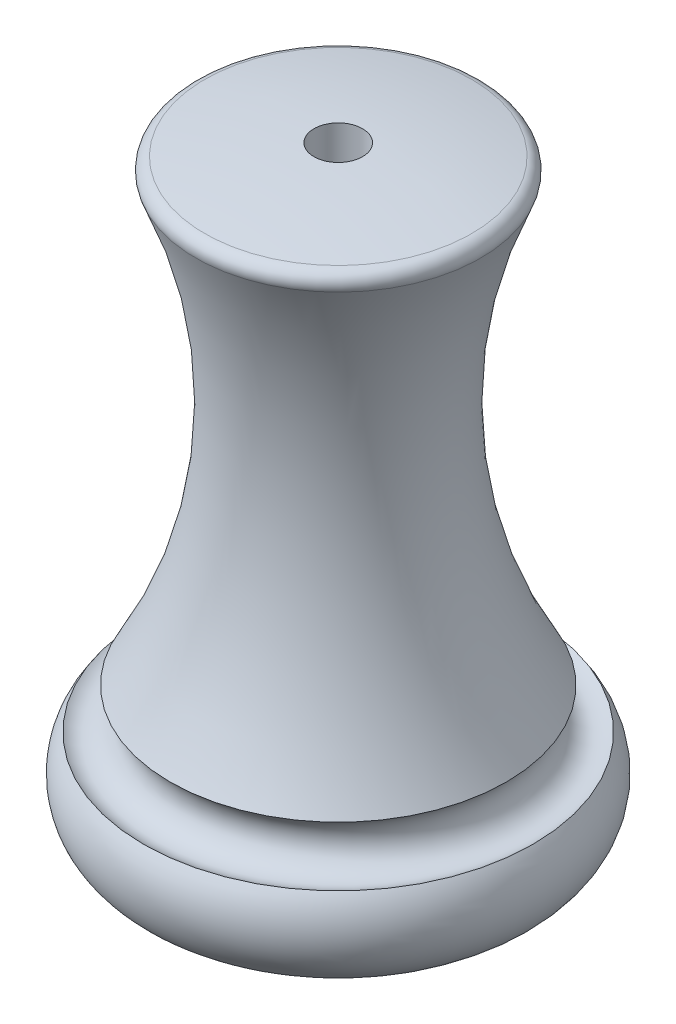
ISO-10303-21;
HEADER;
FILE_DESCRIPTION(('STEP AP214'),'2;1');
FILE_NAME('part.step','',(''),(''),'','','');
FILE_SCHEMA(('AUTOMOTIVE_DESIGN { 1 0 10303 214 1 1 1 1 }'));
ENDSEC;
DATA;
#1=APPLICATION_CONTEXT('core data for automotive mechanical design processes');
#2=APPLICATION_PROTOCOL_DEFINITION('international standard','automotive_design',2000,#1);
#3=PRODUCT_CONTEXT('',#1,'mechanical');
#4=PRODUCT('Part','Part','',(#3));
#5=PRODUCT_RELATED_PRODUCT_CATEGORY('part','',(#4));
#6=PRODUCT_DEFINITION_FORMATION('','',#4);
#7=PRODUCT_DEFINITION_CONTEXT('part definition',#1,'design');
#8=PRODUCT_DEFINITION('design','',#6,#7);
#9=PRODUCT_DEFINITION_SHAPE('','',#8);
#10=(LENGTH_UNIT() NAMED_UNIT(*) SI_UNIT(.MILLI.,.METRE.));
#11=(NAMED_UNIT(*) PLANE_ANGLE_UNIT() SI_UNIT($,.RADIAN.));
#12=(NAMED_UNIT(*) SI_UNIT($,.STERADIAN.) SOLID_ANGLE_UNIT());
#13=UNCERTAINTY_MEASURE_WITH_UNIT(LENGTH_MEASURE(1.E-05),#10,'distance_accuracy_value','');
#14=(GEOMETRIC_REPRESENTATION_CONTEXT(3) GLOBAL_UNCERTAINTY_ASSIGNED_CONTEXT((#13)) GLOBAL_UNIT_ASSIGNED_CONTEXT((#10,
#11,#12)) REPRESENTATION_CONTEXT('',''));
#15=CARTESIAN_POINT('',(0.,0.,0.));
#16=DIRECTION('',(0.,0.,1.));
#17=DIRECTION('',(1.,0.,0.));
#18=AXIS2_PLACEMENT_3D('',#15,#16,#17);
#19=CARTESIAN_POINT('',(0.,-9.99999999999999,0.));
#20=DIRECTION('',(0.,-1.,0.));
#21=DIRECTION('',(0.,0.,-1.));
#22=AXIS2_PLACEMENT_3D('',#19,#20,#21);
#23=SPHERICAL_SURFACE('',#22,60.);
#24=CARTESIAN_POINT('',(0.,49.9666574022598,0.));
#25=DIRECTION('',(0.,-1.,0.));
#26=DIRECTION('',(0.,0.,-1.));
#27=AXIS2_PLACEMENT_3D('',#24,#25,#26);
#28=CIRCLE('',#27,2.);
#29=CARTESIAN_POINT('',(0.,49.9666574022598,-2.));
#30=VERTEX_POINT('',#29);
#31=EDGE_CURVE('E77',#30,#30,#28,.F.);
#32=ORIENTED_EDGE('',*,*,#31,.F.);
#33=EDGE_LOOP('',(#32));
#34=FACE_BOUND('',#33,.T.);
#35=CARTESIAN_POINT('',(0.,48.9830508474576,0.));
#36=DIRECTION('',(0.,-1.,0.));
#37=DIRECTION('',(0.,0.,-1.));
#38=AXIS2_PLACEMENT_3D('',#35,#36,#37);
#39=CIRCLE('',#38,10.9999869420935);
#40=CARTESIAN_POINT('',(0.,48.9830508474576,-10.9999869420935));
#41=VERTEX_POINT('',#40);
#42=EDGE_CURVE('E12',#41,#41,#39,.T.);
#43=ORIENTED_EDGE('',*,*,#42,.F.);
#44=EDGE_LOOP('',(#43));
#45=FACE_BOUND('',#44,.T.);
#46=ADVANCED_FACE('F47',(#34,#45),#23,.T.);
#47=CARTESIAN_POINT('',(0.,48.,0.));
#48=DIRECTION('',(0.,-1.,0.));
#49=DIRECTION('',(0.,0.,-1.));
#50=AXIS2_PLACEMENT_3D('',#47,#48,#49);
#51=TOROIDAL_SURFACE('',#50,10.816653826392,1.00000000000001);
#52=ORIENTED_EDGE('',*,*,#42,.T.);
#53=EDGE_LOOP('',(#52));
#54=FACE_BOUND('',#53,.T.);
#55=CARTESIAN_POINT('',(0.,47.5979713569628,0.));
#56=DIRECTION('',(0.,-1.,0.));
#57=DIRECTION('',(0.,0.,-1.));
#58=AXIS2_PLACEMENT_3D('',#55,#56,#57);
#59=CIRCLE('',#58,11.7322809176129);
#60=CARTESIAN_POINT('',(0.,47.5979713569628,-11.7322809176129));
#61=VERTEX_POINT('',#60);
#62=EDGE_CURVE('E55',#61,#61,#59,.T.);
#63=ORIENTED_EDGE('',*,*,#62,.F.);
#64=EDGE_LOOP('',(#63));
#65=FACE_BOUND('',#64,.T.);
#66=ADVANCED_FACE('F104',(#54,#65),#51,.T.);
#67=CARTESIAN_POINT('',(0.,31.5168256354762,0.));
#68=DIRECTION('',(0.,-1.,0.));
#69=DIRECTION('',(0.,0.,-1.));
#70=AXIS2_PLACEMENT_3D('',#67,#68,#69);
#71=TOROIDAL_SURFACE('',#70,48.35736456645,40.);
#72=CARTESIAN_POINT('',(0.,11.2908100700562,0.));
#73=DIRECTION('',(0.,1.,0.));
#74=DIRECTION('',(0.,0.,1.));
#75=AXIS2_PLACEMENT_3D('',#72,#73,#74);
#76=CIRCLE('',#75,13.8478253874434);
#77=CARTESIAN_POINT('',(0.,11.2908100700562,13.8478253874434));
#78=VERTEX_POINT('',#77);
#79=EDGE_CURVE('E67',#78,#78,#76,.F.);
#80=ORIENTED_EDGE('',*,*,#79,.F.);
#81=EDGE_LOOP('',(#80));
#82=FACE_BOUND('',#81,.T.);
#83=ORIENTED_EDGE('',*,*,#62,.T.);
#84=EDGE_LOOP('',(#83));
#85=FACE_BOUND('',#84,.T.);
#86=ADVANCED_FACE('F109',(#82,#85),#71,.F.);
#87=CARTESIAN_POINT('',(0.,9.59115492639038,0.));
#88=DIRECTION('',(0.,-1.,0.));
#89=DIRECTION('',(0.,0.,-1.));
#90=AXIS2_PLACEMENT_3D('',#87,#88,#89);
#91=TOROIDAL_SURFACE('',#90,14.9019470087997,2.);
#92=ORIENTED_EDGE('',*,*,#79,.T.);
#93=EDGE_LOOP('',(#92));
#94=FACE_BOUND('',#93,.T.);
#95=CARTESIAN_POINT('',(0.,7.94631395949735,0.));
#96=DIRECTION('',(0.,1.,0.));
#97=DIRECTION('',(0.,0.,1.));
#98=AXIS2_PLACEMENT_3D('',#95,#96,#97);
#99=CIRCLE('',#98,16.03970717405);
#100=CARTESIAN_POINT('',(0.,7.94631395949735,16.03970717405));
#101=VERTEX_POINT('',#100);
#102=EDGE_CURVE('E73',#101,#101,#99,.T.);
#103=ORIENTED_EDGE('',*,*,#102,.T.);
#104=EDGE_LOOP('',(#103));
#105=FACE_BOUND('',#104,.T.);
#106=ADVANCED_FACE('F89',(#94,#105),#91,.F.);
#107=CARTESIAN_POINT('',(0.,0.,-12.));
#108=DIRECTION('',(0.,-1.,0.));
#109=DIRECTION('',(0.,0.,-1.));
#110=AXIS2_PLACEMENT_3D('',#107,#108,#109);
#111=PLANE('',#110);
#112=CARTESIAN_POINT('',(0.,0.,0.));
#113=DIRECTION('',(0.,-1.,0.));
#114=DIRECTION('',(0.,0.,-1.));
#115=AXIS2_PLACEMENT_3D('',#112,#113,#114);
#116=CIRCLE('',#115,2.);
#117=CARTESIAN_POINT('',(0.,0.,-2.));
#118=VERTEX_POINT('',#117);
#119=EDGE_CURVE('E80',#118,#118,#116,.T.);
#120=ORIENTED_EDGE('',*,*,#119,.F.);
#121=EDGE_LOOP('',(#120));
#122=FACE_BOUND('',#121,.T.);
#123=CARTESIAN_POINT('',(0.,0.,0.));
#124=DIRECTION('',(0.,-1.,0.));
#125=DIRECTION('',(0.,0.,-1.));
#126=AXIS2_PLACEMENT_3D('',#123,#124,#125);
#127=CIRCLE('',#126,12.);
#128=CARTESIAN_POINT('',(0.,0.,-12.));
#129=VERTEX_POINT('',#128);
#130=EDGE_CURVE('E62',#129,#129,#127,.T.);
#131=ORIENTED_EDGE('',*,*,#130,.T.);
#132=EDGE_LOOP('',(#131));
#133=FACE_BOUND('',#132,.T.);
#134=ADVANCED_FACE('F49',(#122,#133),#111,.T.);
#135=CARTESIAN_POINT('',(0.,5.,0.));
#136=DIRECTION('',(0.,-1.,0.));
#137=DIRECTION('',(0.,0.,-1.));
#138=AXIS2_PLACEMENT_3D('',#135,#136,#137);
#139=TOROIDAL_SURFACE('',#138,12.,5.);
#140=ORIENTED_EDGE('',*,*,#102,.F.);
#141=EDGE_LOOP('',(#140));
#142=FACE_BOUND('',#141,.T.);
#143=ORIENTED_EDGE('',*,*,#130,.F.);
#144=EDGE_LOOP('',(#143));
#145=FACE_BOUND('',#144,.T.);
#146=ADVANCED_FACE('F88',(#142,#145),#139,.T.);
#147=CARTESIAN_POINT('',(0.,50.,0.));
#148=DIRECTION('',(0.,-1.,0.));
#149=DIRECTION('',(0.,0.,-1.));
#150=AXIS2_PLACEMENT_3D('',#147,#148,#149);
#151=CYLINDRICAL_SURFACE('',#150,2.);
#152=ORIENTED_EDGE('',*,*,#31,.T.);
#153=EDGE_LOOP('',(#152));
#154=FACE_BOUND('',#153,.T.);
#155=ORIENTED_EDGE('',*,*,#119,.T.);
#156=EDGE_LOOP('',(#155));
#157=FACE_BOUND('',#156,.T.);
#158=ADVANCED_FACE('F84',(#154,#157),#151,.F.);
#159=CLOSED_SHELL('',(#46,#66,#86,#106,#134,#146,#158));
#160=MANIFOLD_SOLID_BREP('B2',#159);
#161=ADVANCED_BREP_SHAPE_REPRESENTATION('',(#18,#160),#14);
#162=SHAPE_DEFINITION_REPRESENTATION(#9,#161);
ENDSEC;
END-ISO-10303-21;
